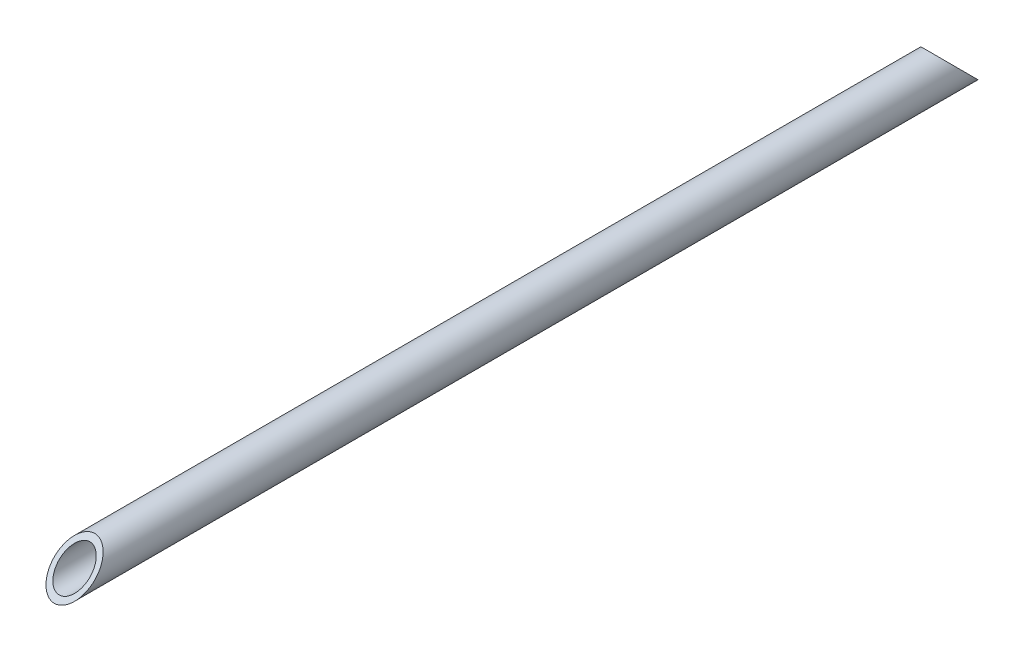
ISO-10303-21;
HEADER;
FILE_DESCRIPTION(('STEP AP214'),'2;1');
FILE_NAME('part.step','',(''),(''),'','','');
FILE_SCHEMA(('AUTOMOTIVE_DESIGN { 1 0 10303 214 1 1 1 1 }'));
ENDSEC;
DATA;
#1=APPLICATION_CONTEXT('core data for automotive mechanical design processes');
#2=APPLICATION_PROTOCOL_DEFINITION('international standard','automotive_design',2000,#1);
#3=PRODUCT_CONTEXT('',#1,'mechanical');
#4=PRODUCT('Part','Part','',(#3));
#5=PRODUCT_RELATED_PRODUCT_CATEGORY('part','',(#4));
#6=PRODUCT_DEFINITION_FORMATION('','',#4);
#7=PRODUCT_DEFINITION_CONTEXT('part definition',#1,'design');
#8=PRODUCT_DEFINITION('design','',#6,#7);
#9=PRODUCT_DEFINITION_SHAPE('','',#8);
#10=(LENGTH_UNIT() NAMED_UNIT(*) SI_UNIT(.MILLI.,.METRE.));
#11=(NAMED_UNIT(*) PLANE_ANGLE_UNIT() SI_UNIT($,.RADIAN.));
#12=(NAMED_UNIT(*) SI_UNIT($,.STERADIAN.) SOLID_ANGLE_UNIT());
#13=UNCERTAINTY_MEASURE_WITH_UNIT(LENGTH_MEASURE(1.E-05),#10,'distance_accuracy_value','');
#14=(GEOMETRIC_REPRESENTATION_CONTEXT(3) GLOBAL_UNCERTAINTY_ASSIGNED_CONTEXT((#13)) GLOBAL_UNIT_ASSIGNED_CONTEXT((#10,
#11,#12)) REPRESENTATION_CONTEXT('',''));
#15=CARTESIAN_POINT('',(0.,0.,0.));
#16=DIRECTION('',(0.,0.,1.));
#17=DIRECTION('',(1.,0.,0.));
#18=AXIS2_PLACEMENT_3D('',#15,#16,#17);
#19=CARTESIAN_POINT('',(2599.99999999996,0.,-275.000000000001));
#20=DIRECTION('',(0.,0.,1.));
#21=DIRECTION('',(0.,-1.,0.));
#22=AXIS2_PLACEMENT_3D('',#19,#20,#21);
#23=CYLINDRICAL_SURFACE('',#22,9.64999999999982);
#24=CARTESIAN_POINT('',(2599.99999999996,0.,-275.000000000001));
#25=DIRECTION('',(0.,0.707106781186548,-0.707106781186547));
#26=DIRECTION('',(0.,0.707106781186548,0.707106781186547));
#27=AXIS2_PLACEMENT_3D('',#24,#25,#26);
#28=ELLIPSE('',#27,13.6471608769,9.64999999999982);
#29=CARTESIAN_POINT('',(2599.99999999996,9.64999999999974,-265.350000000001));
#30=VERTEX_POINT('',#29);
#31=EDGE_CURVE('E57',#30,#30,#28,.T.);
#32=ORIENTED_EDGE('',*,*,#31,.T.);
#33=EDGE_LOOP('',(#32));
#34=FACE_BOUND('',#33,.T.);
#35=CARTESIAN_POINT('',(2599.99999999996,-4.18287908650339E-12,275.));
#36=DIRECTION('',(0.,0.707106781186547,0.707106781186547));
#37=DIRECTION('',(0.,-0.707106781186548,0.707106781186547));
#38=AXIS2_PLACEMENT_3D('',#35,#36,#37);
#39=ELLIPSE('',#38,13.6471608769002,9.64999999999982);
#40=CARTESIAN_POINT('',(2599.99999999996,-9.65000000000407,284.65));
#41=VERTEX_POINT('',#40);
#42=EDGE_CURVE('E44',#41,#41,#39,.T.);
#43=ORIENTED_EDGE('',*,*,#42,.T.);
#44=EDGE_LOOP('',(#43));
#45=FACE_BOUND('',#44,.T.);
#46=ADVANCED_FACE('F40',(#34,#45),#23,.F.);
#47=CARTESIAN_POINT('',(2599.99999999996,0.,-275.000000000001));
#48=DIRECTION('',(0.,0.,1.));
#49=DIRECTION('',(0.,-1.,0.));
#50=AXIS2_PLACEMENT_3D('',#47,#48,#49);
#51=CYLINDRICAL_SURFACE('',#50,12.6999999999999);
#52=CARTESIAN_POINT('',(2599.99999999996,0.,-275.000000000001));
#53=DIRECTION('',(0.,0.707106781186548,-0.707106781186547));
#54=DIRECTION('',(0.,0.707106781186548,0.707106781186547));
#55=AXIS2_PLACEMENT_3D('',#52,#53,#54);
#56=ELLIPSE('',#55,17.960512242138,12.6999999999999);
#57=CARTESIAN_POINT('',(2599.99999999996,12.6999999999998,-262.300000000001));
#58=VERTEX_POINT('',#57);
#59=EDGE_CURVE('E49',#58,#58,#56,.T.);
#60=ORIENTED_EDGE('',*,*,#59,.F.);
#61=EDGE_LOOP('',(#60));
#62=FACE_BOUND('',#61,.T.);
#63=CARTESIAN_POINT('',(2599.99999999996,-4.18287908650339E-12,275.));
#64=DIRECTION('',(0.,0.707106781186547,0.707106781186547));
#65=DIRECTION('',(0.,-0.707106781186548,0.707106781186547));
#66=AXIS2_PLACEMENT_3D('',#63,#64,#65);
#67=ELLIPSE('',#66,17.9605122421383,12.6999999999999);
#68=CARTESIAN_POINT('',(2599.99999999996,-12.7000000000042,287.7));
#69=VERTEX_POINT('',#68);
#70=EDGE_CURVE('E10',#69,#69,#67,.T.);
#71=ORIENTED_EDGE('',*,*,#70,.F.);
#72=EDGE_LOOP('',(#71));
#73=FACE_BOUND('',#72,.T.);
#74=ADVANCED_FACE('F75',(#62,#73),#51,.T.);
#75=CARTESIAN_POINT('',(2599.99999999996,0.,-275.000000000001));
#76=DIRECTION('',(0.,0.707106781186548,-0.707106781186547));
#77=DIRECTION('',(0.,0.707106781186548,0.707106781186547));
#78=AXIS2_PLACEMENT_3D('',#75,#76,#77);
#79=PLANE('',#78);
#80=ORIENTED_EDGE('',*,*,#31,.F.);
#81=EDGE_LOOP('',(#80));
#82=FACE_BOUND('',#81,.T.);
#83=ORIENTED_EDGE('',*,*,#59,.T.);
#84=EDGE_LOOP('',(#83));
#85=FACE_BOUND('',#84,.T.);
#86=ADVANCED_FACE('F70',(#82,#85),#79,.T.);
#87=CARTESIAN_POINT('',(2599.99999999996,-4.18287908650339E-12,275.));
#88=DIRECTION('',(0.,0.707106781186547,0.707106781186547));
#89=DIRECTION('',(0.,-0.707106781186548,0.707106781186547));
#90=AXIS2_PLACEMENT_3D('',#87,#88,#89);
#91=PLANE('',#90);
#92=ORIENTED_EDGE('',*,*,#42,.F.);
#93=EDGE_LOOP('',(#92));
#94=FACE_BOUND('',#93,.T.);
#95=ORIENTED_EDGE('',*,*,#70,.T.);
#96=EDGE_LOOP('',(#95));
#97=FACE_BOUND('',#96,.T.);
#98=ADVANCED_FACE('F42',(#94,#97),#91,.T.);
#99=CLOSED_SHELL('',(#46,#74,#86,#98));
#100=MANIFOLD_SOLID_BREP('B2',#99);
#101=ADVANCED_BREP_SHAPE_REPRESENTATION('',(#18,#100),#14);
#102=SHAPE_DEFINITION_REPRESENTATION(#9,#101);
ENDSEC;
END-ISO-10303-21;
